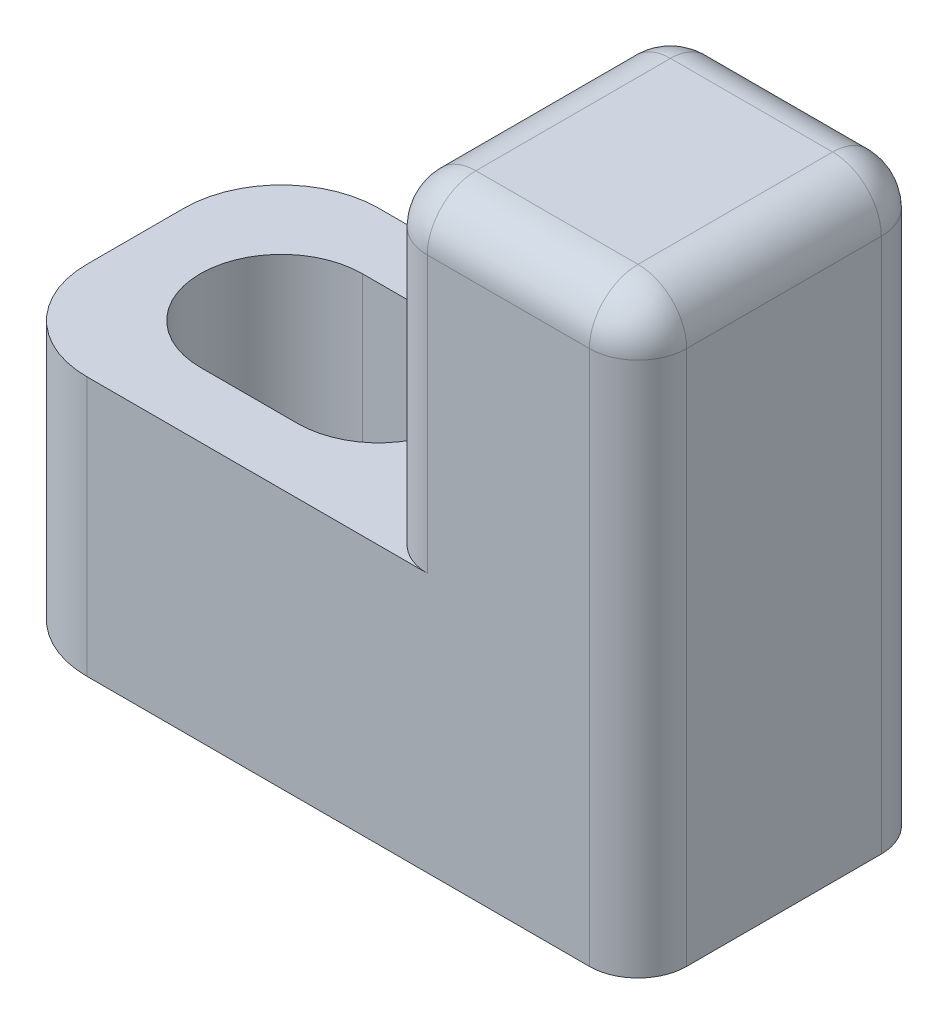
ISO-10303-21;
HEADER;
FILE_DESCRIPTION(('STEP AP214'),'2;1');
FILE_NAME('part.step','',(''),(''),'','','');
FILE_SCHEMA(('AUTOMOTIVE_DESIGN { 1 0 10303 214 1 1 1 1 }'));
ENDSEC;
DATA;
#1=APPLICATION_CONTEXT('core data for automotive mechanical design processes');
#2=APPLICATION_PROTOCOL_DEFINITION('international standard','automotive_design',2000,#1);
#3=PRODUCT_CONTEXT('',#1,'mechanical');
#4=PRODUCT('Part','Part','',(#3));
#5=PRODUCT_RELATED_PRODUCT_CATEGORY('part','',(#4));
#6=PRODUCT_DEFINITION_FORMATION('','',#4);
#7=PRODUCT_DEFINITION_CONTEXT('part definition',#1,'design');
#8=PRODUCT_DEFINITION('design','',#6,#7);
#9=PRODUCT_DEFINITION_SHAPE('','',#8);
#10=(LENGTH_UNIT() NAMED_UNIT(*) SI_UNIT(.MILLI.,.METRE.));
#11=(NAMED_UNIT(*) PLANE_ANGLE_UNIT() SI_UNIT($,.RADIAN.));
#12=(NAMED_UNIT(*) SI_UNIT($,.STERADIAN.) SOLID_ANGLE_UNIT());
#13=UNCERTAINTY_MEASURE_WITH_UNIT(LENGTH_MEASURE(1.E-05),#10,'distance_accuracy_value','');
#14=(GEOMETRIC_REPRESENTATION_CONTEXT(3) GLOBAL_UNCERTAINTY_ASSIGNED_CONTEXT((#13)) GLOBAL_UNIT_ASSIGNED_CONTEXT((#10,
#11,#12)) REPRESENTATION_CONTEXT('',''));
#15=CARTESIAN_POINT('',(0.,0.,0.));
#16=DIRECTION('',(0.,0.,1.));
#17=DIRECTION('',(1.,0.,0.));
#18=AXIS2_PLACEMENT_3D('',#15,#16,#17);
#19=CARTESIAN_POINT('',(0.,8.,0.));
#20=DIRECTION('',(0.,1.,0.));
#21=DIRECTION('',(0.,0.,1.));
#22=AXIS2_PLACEMENT_3D('',#19,#20,#21);
#23=PLANE('',#22);
#24=DIRECTION('',(-1.,0.,0.));
#25=VECTOR('',#24,1.);
#26=CARTESIAN_POINT('',(-10.,8.,-4.5));
#27=LINE('',#26,#25);
#28=CARTESIAN_POINT('',(3.5,8.,-4.5));
#29=VERTEX_POINT('',#28);
#30=CARTESIAN_POINT('',(-7.,8.,-4.5));
#31=VERTEX_POINT('',#30);
#32=EDGE_CURVE('E209',#29,#31,#27,.T.);
#33=ORIENTED_EDGE('',*,*,#32,.T.);
#34=CARTESIAN_POINT('',(-7.,8.,-1.5));
#35=DIRECTION('',(0.,1.,0.));
#36=DIRECTION('',(0.,0.,1.));
#37=AXIS2_PLACEMENT_3D('',#34,#35,#36);
#38=CIRCLE('',#37,3.);
#39=CARTESIAN_POINT('',(-10.,8.,-1.5));
#40=VERTEX_POINT('',#39);
#41=EDGE_CURVE('E241',#31,#40,#38,.T.);
#42=ORIENTED_EDGE('',*,*,#41,.T.);
#43=DIRECTION('',(0.,0.,1.));
#44=VECTOR('',#43,1.);
#45=CARTESIAN_POINT('',(-10.,8.,-4.5));
#46=LINE('',#45,#44);
#47=CARTESIAN_POINT('',(-10.,8.,1.5));
#48=VERTEX_POINT('',#47);
#49=EDGE_CURVE('E212',#40,#48,#46,.T.);
#50=ORIENTED_EDGE('',*,*,#49,.T.);
#51=CARTESIAN_POINT('',(-7.,8.,1.5));
#52=DIRECTION('',(0.,1.,0.));
#53=DIRECTION('',(0.,0.,1.));
#54=AXIS2_PLACEMENT_3D('',#51,#52,#53);
#55=CIRCLE('',#54,3.);
#56=CARTESIAN_POINT('',(-7.,8.,4.5));
#57=VERTEX_POINT('',#56);
#58=EDGE_CURVE('E239',#48,#57,#55,.T.);
#59=ORIENTED_EDGE('',*,*,#58,.T.);
#60=DIRECTION('',(1.,0.,0.));
#61=VECTOR('',#60,1.);
#62=CARTESIAN_POINT('',(-10.,8.,4.5));
#63=LINE('',#62,#61);
#64=CARTESIAN_POINT('',(3.5,8.,4.5));
#65=VERTEX_POINT('',#64);
#66=EDGE_CURVE('E216',#57,#65,#63,.T.);
#67=ORIENTED_EDGE('',*,*,#66,.T.);
#68=CARTESIAN_POINT('',(3.5,8.,3.));
#69=DIRECTION('',(0.,1.,0.));
#70=DIRECTION('',(0.,0.,1.));
#71=AXIS2_PLACEMENT_3D('',#68,#69,#70);
#72=CIRCLE('',#71,1.5);
#73=CARTESIAN_POINT('',(2.,8.,3.));
#74=VERTEX_POINT('',#73);
#75=EDGE_CURVE('E11',#65,#74,#72,.F.);
#76=ORIENTED_EDGE('',*,*,#75,.T.);
#77=DIRECTION('',(0.,0.,1.));
#78=VECTOR('',#77,1.);
#79=CARTESIAN_POINT('',(2.,8.,-4.5));
#80=LINE('',#79,#78);
#81=CARTESIAN_POINT('',(2.,8.,-3.));
#82=VERTEX_POINT('',#81);
#83=EDGE_CURVE('E198',#82,#74,#80,.T.);
#84=ORIENTED_EDGE('',*,*,#83,.F.);
#85=CARTESIAN_POINT('',(3.5,8.,-3.));
#86=DIRECTION('',(0.,1.,0.));
#87=DIRECTION('',(0.,0.,1.));
#88=AXIS2_PLACEMENT_3D('',#85,#86,#87);
#89=CIRCLE('',#88,1.5);
#90=EDGE_CURVE('E48',#82,#29,#89,.F.);
#91=ORIENTED_EDGE('',*,*,#90,.T.);
#92=EDGE_LOOP('',(#33,#42,#50,#59,#67,#76,#84,#91));
#93=FACE_BOUND('',#92,.T.);
#94=DIRECTION('',(1.,0.,0.));
#95=VECTOR('',#94,1.);
#96=CARTESIAN_POINT('',(-5.5,8.,2.5));
#97=LINE('',#96,#95);
#98=CARTESIAN_POINT('',(-5.5,8.,2.5));
#99=VERTEX_POINT('',#98);
#100=CARTESIAN_POINT('',(-2.5,8.,2.5));
#101=VERTEX_POINT('',#100);
#102=EDGE_CURVE('E176',#99,#101,#97,.T.);
#103=ORIENTED_EDGE('',*,*,#102,.F.);
#104=CARTESIAN_POINT('',(-5.5,8.,0.));
#105=DIRECTION('',(0.,1.,0.));
#106=DIRECTION('',(0.,0.,1.));
#107=AXIS2_PLACEMENT_3D('',#104,#105,#106);
#108=CIRCLE('',#107,2.5);
#109=CARTESIAN_POINT('',(-5.5,8.,-2.5));
#110=VERTEX_POINT('',#109);
#111=EDGE_CURVE('E166',#110,#99,#108,.T.);
#112=ORIENTED_EDGE('',*,*,#111,.F.);
#113=DIRECTION('',(-1.,0.,0.));
#114=VECTOR('',#113,1.);
#115=CARTESIAN_POINT('',(-5.5,8.,-2.5));
#116=LINE('',#115,#114);
#117=CARTESIAN_POINT('',(-2.5,8.,-2.5));
#118=VERTEX_POINT('',#117);
#119=EDGE_CURVE('E191',#118,#110,#116,.T.);
#120=ORIENTED_EDGE('',*,*,#119,.F.);
#121=CARTESIAN_POINT('',(-2.5,8.,0.));
#122=DIRECTION('',(0.,1.,0.));
#123=DIRECTION('',(0.,0.,1.));
#124=AXIS2_PLACEMENT_3D('',#121,#122,#123);
#125=CIRCLE('',#124,2.5);
#126=EDGE_CURVE('E189',#101,#118,#125,.T.);
#127=ORIENTED_EDGE('',*,*,#126,.F.);
#128=EDGE_LOOP('',(#103,#112,#120,#127));
#129=FACE_BOUND('',#128,.T.);
#130=ADVANCED_FACE('F39',(#93,#129),#23,.T.);
#131=CARTESIAN_POINT('',(0.,0.,0.));
#132=DIRECTION('',(0.,1.,0.));
#133=DIRECTION('',(0.,0.,1.));
#134=AXIS2_PLACEMENT_3D('',#131,#132,#133);
#135=PLANE('',#134);
#136=DIRECTION('',(-1.,0.,0.));
#137=VECTOR('',#136,1.);
#138=CARTESIAN_POINT('',(-10.,0.,-4.5));
#139=LINE('',#138,#137);
#140=CARTESIAN_POINT('',(8.5,0.,-4.5));
#141=VERTEX_POINT('',#140);
#142=CARTESIAN_POINT('',(-7.,0.,-4.5));
#143=VERTEX_POINT('',#142);
#144=EDGE_CURVE('E221',#141,#143,#139,.T.);
#145=ORIENTED_EDGE('',*,*,#144,.F.);
#146=CARTESIAN_POINT('',(8.5,0.,-3.));
#147=DIRECTION('',(0.,1.,0.));
#148=DIRECTION('',(0.,0.,1.));
#149=AXIS2_PLACEMENT_3D('',#146,#147,#148);
#150=CIRCLE('',#149,1.5);
#151=CARTESIAN_POINT('',(10.,0.,-3.));
#152=VERTEX_POINT('',#151);
#153=EDGE_CURVE('E255',#141,#152,#150,.F.);
#154=ORIENTED_EDGE('',*,*,#153,.T.);
#155=DIRECTION('',(0.,0.,-1.));
#156=VECTOR('',#155,1.);
#157=CARTESIAN_POINT('',(10.,0.,-4.5));
#158=LINE('',#157,#156);
#159=CARTESIAN_POINT('',(10.,0.,3.));
#160=VERTEX_POINT('',#159);
#161=EDGE_CURVE('E184',#160,#152,#158,.T.);
#162=ORIENTED_EDGE('',*,*,#161,.F.);
#163=CARTESIAN_POINT('',(8.5,0.,3.));
#164=DIRECTION('',(0.,1.,0.));
#165=DIRECTION('',(0.,0.,1.));
#166=AXIS2_PLACEMENT_3D('',#163,#164,#165);
#167=CIRCLE('',#166,1.5);
#168=CARTESIAN_POINT('',(8.5,0.,4.5));
#169=VERTEX_POINT('',#168);
#170=EDGE_CURVE('E253',#160,#169,#167,.F.);
#171=ORIENTED_EDGE('',*,*,#170,.T.);
#172=DIRECTION('',(1.,0.,0.));
#173=VECTOR('',#172,1.);
#174=CARTESIAN_POINT('',(-10.,0.,4.5));
#175=LINE('',#174,#173);
#176=CARTESIAN_POINT('',(-7.,0.,4.5));
#177=VERTEX_POINT('',#176);
#178=EDGE_CURVE('E213',#177,#169,#175,.T.);
#179=ORIENTED_EDGE('',*,*,#178,.F.);
#180=CARTESIAN_POINT('',(-7.,0.,1.5));
#181=DIRECTION('',(0.,1.,0.));
#182=DIRECTION('',(0.,0.,1.));
#183=AXIS2_PLACEMENT_3D('',#180,#181,#182);
#184=CIRCLE('',#183,3.);
#185=CARTESIAN_POINT('',(-10.,0.,1.5));
#186=VERTEX_POINT('',#185);
#187=EDGE_CURVE('E232',#177,#186,#184,.F.);
#188=ORIENTED_EDGE('',*,*,#187,.T.);
#189=DIRECTION('',(0.,0.,1.));
#190=VECTOR('',#189,1.);
#191=CARTESIAN_POINT('',(-10.,0.,-4.5));
#192=LINE('',#191,#190);
#193=CARTESIAN_POINT('',(-10.,0.,-1.5));
#194=VERTEX_POINT('',#193);
#195=EDGE_CURVE('E223',#194,#186,#192,.T.);
#196=ORIENTED_EDGE('',*,*,#195,.F.);
#197=CARTESIAN_POINT('',(-7.,0.,-1.5));
#198=DIRECTION('',(0.,1.,0.));
#199=DIRECTION('',(0.,0.,1.));
#200=AXIS2_PLACEMENT_3D('',#197,#198,#199);
#201=CIRCLE('',#200,3.);
#202=EDGE_CURVE('E234',#194,#143,#201,.F.);
#203=ORIENTED_EDGE('',*,*,#202,.T.);
#204=EDGE_LOOP('',(#145,#154,#162,#171,#179,#188,#196,#203));
#205=FACE_BOUND('',#204,.T.);
#206=CARTESIAN_POINT('',(-5.5,0.,0.));
#207=DIRECTION('',(0.,1.,0.));
#208=DIRECTION('',(0.,0.,1.));
#209=AXIS2_PLACEMENT_3D('',#206,#207,#208);
#210=CIRCLE('',#209,2.5);
#211=CARTESIAN_POINT('',(-5.5,0.,-2.5));
#212=VERTEX_POINT('',#211);
#213=CARTESIAN_POINT('',(-5.5,0.,2.5));
#214=VERTEX_POINT('',#213);
#215=EDGE_CURVE('E196',#212,#214,#210,.T.);
#216=ORIENTED_EDGE('',*,*,#215,.T.);
#217=DIRECTION('',(1.,0.,0.));
#218=VECTOR('',#217,1.);
#219=CARTESIAN_POINT('',(-5.5,0.,2.5));
#220=LINE('',#219,#218);
#221=CARTESIAN_POINT('',(-2.5,0.,2.5));
#222=VERTEX_POINT('',#221);
#223=EDGE_CURVE('E183',#214,#222,#220,.T.);
#224=ORIENTED_EDGE('',*,*,#223,.T.);
#225=CARTESIAN_POINT('',(-2.5,0.,0.));
#226=DIRECTION('',(0.,1.,0.));
#227=DIRECTION('',(0.,0.,1.));
#228=AXIS2_PLACEMENT_3D('',#225,#226,#227);
#229=CIRCLE('',#228,2.5);
#230=CARTESIAN_POINT('',(-2.5,0.,-2.5));
#231=VERTEX_POINT('',#230);
#232=EDGE_CURVE('E200',#222,#231,#229,.T.);
#233=ORIENTED_EDGE('',*,*,#232,.T.);
#234=DIRECTION('',(-1.,0.,0.));
#235=VECTOR('',#234,1.);
#236=CARTESIAN_POINT('',(-5.5,0.,-2.5));
#237=LINE('',#236,#235);
#238=EDGE_CURVE('E177',#231,#212,#237,.T.);
#239=ORIENTED_EDGE('',*,*,#238,.T.);
#240=EDGE_LOOP('',(#216,#224,#233,#239));
#241=FACE_BOUND('',#240,.T.);
#242=ADVANCED_FACE('F358',(#205,#241),#135,.F.);
#243=CARTESIAN_POINT('',(10.,8.,-4.5));
#244=DIRECTION('',(-1.,0.,0.));
#245=DIRECTION('',(0.,0.,1.));
#246=AXIS2_PLACEMENT_3D('',#243,#244,#245);
#247=PLANE('',#246);
#248=ORIENTED_EDGE('',*,*,#161,.T.);
#249=DIRECTION('',(0.,-1.,0.));
#250=VECTOR('',#249,1.);
#251=CARTESIAN_POINT('',(10.,8.,-3.));
#252=LINE('',#251,#250);
#253=CARTESIAN_POINT('',(10.,16.5,-3.));
#254=VERTEX_POINT('',#253);
#255=EDGE_CURVE('E261',#152,#254,#252,.F.);
#256=ORIENTED_EDGE('',*,*,#255,.T.);
#257=DIRECTION('',(0.,0.,-1.));
#258=VECTOR('',#257,1.);
#259=CARTESIAN_POINT('',(10.,16.5,-4.5));
#260=LINE('',#259,#258);
#261=CARTESIAN_POINT('',(10.,16.5,3.));
#262=VERTEX_POINT('',#261);
#263=EDGE_CURVE('E257',#254,#262,#260,.F.);
#264=ORIENTED_EDGE('',*,*,#263,.T.);
#265=DIRECTION('',(0.,-1.,0.));
#266=VECTOR('',#265,1.);
#267=CARTESIAN_POINT('',(10.,8.,3.));
#268=LINE('',#267,#266);
#269=EDGE_CURVE('E259',#262,#160,#268,.T.);
#270=ORIENTED_EDGE('',*,*,#269,.T.);
#271=EDGE_LOOP('',(#248,#256,#264,#270));
#272=FACE_BOUND('',#271,.T.);
#273=ADVANCED_FACE('F392',(#272),#247,.F.);
#274=CARTESIAN_POINT('',(-10.,8.,-4.5));
#275=DIRECTION('',(0.,0.,1.));
#276=DIRECTION('',(1.,0.,0.));
#277=AXIS2_PLACEMENT_3D('',#274,#275,#276);
#278=PLANE('',#277);
#279=DIRECTION('',(-1.,0.,0.));
#280=VECTOR('',#279,1.);
#281=CARTESIAN_POINT('',(-10.,16.5,-4.5));
#282=LINE('',#281,#280);
#283=CARTESIAN_POINT('',(3.5,16.5,-4.5));
#284=VERTEX_POINT('',#283);
#285=CARTESIAN_POINT('',(8.5,16.5,-4.5));
#286=VERTEX_POINT('',#285);
#287=EDGE_CURVE('E246',#284,#286,#282,.F.);
#288=ORIENTED_EDGE('',*,*,#287,.T.);
#289=DIRECTION('',(0.,-1.,0.));
#290=VECTOR('',#289,1.);
#291=CARTESIAN_POINT('',(8.5,8.,-4.5));
#292=LINE('',#291,#290);
#293=EDGE_CURVE('E250',#286,#141,#292,.T.);
#294=ORIENTED_EDGE('',*,*,#293,.T.);
#295=ORIENTED_EDGE('',*,*,#144,.T.);
#296=DIRECTION('',(0.,-1.,0.));
#297=VECTOR('',#296,1.);
#298=CARTESIAN_POINT('',(-7.,8.,-4.5));
#299=LINE('',#298,#297);
#300=EDGE_CURVE('E237',#143,#31,#299,.F.);
#301=ORIENTED_EDGE('',*,*,#300,.T.);
#302=ORIENTED_EDGE('',*,*,#32,.F.);
#303=DIRECTION('',(0.,-1.,0.));
#304=VECTOR('',#303,1.);
#305=CARTESIAN_POINT('',(3.5,8.,-4.5));
#306=LINE('',#305,#304);
#307=EDGE_CURVE('E248',#29,#284,#306,.F.);
#308=ORIENTED_EDGE('',*,*,#307,.T.);
#309=EDGE_LOOP('',(#288,#294,#295,#301,#302,#308));
#310=FACE_BOUND('',#309,.T.);
#311=ADVANCED_FACE('F389',(#310),#278,.F.);
#312=CARTESIAN_POINT('',(-10.,8.,-4.5));
#313=DIRECTION('',(1.,0.,0.));
#314=DIRECTION('',(0.,0.,-1.));
#315=AXIS2_PLACEMENT_3D('',#312,#313,#314);
#316=PLANE('',#315);
#317=ORIENTED_EDGE('',*,*,#49,.F.);
#318=DIRECTION('',(0.,-1.,0.));
#319=VECTOR('',#318,1.);
#320=CARTESIAN_POINT('',(-10.,8.,-1.5));
#321=LINE('',#320,#319);
#322=EDGE_CURVE('E229',#40,#194,#321,.T.);
#323=ORIENTED_EDGE('',*,*,#322,.T.);
#324=ORIENTED_EDGE('',*,*,#195,.T.);
#325=DIRECTION('',(0.,-1.,0.));
#326=VECTOR('',#325,1.);
#327=CARTESIAN_POINT('',(-10.,8.,1.5));
#328=LINE('',#327,#326);
#329=EDGE_CURVE('E218',#186,#48,#328,.F.);
#330=ORIENTED_EDGE('',*,*,#329,.T.);
#331=EDGE_LOOP('',(#317,#323,#324,#330));
#332=FACE_BOUND('',#331,.T.);
#333=ADVANCED_FACE('F354',(#332),#316,.F.);
#334=CARTESIAN_POINT('',(-10.,8.,4.5));
#335=DIRECTION('',(0.,0.,-1.));
#336=DIRECTION('',(-1.,0.,0.));
#337=AXIS2_PLACEMENT_3D('',#334,#335,#336);
#338=PLANE('',#337);
#339=DIRECTION('',(0.,-1.,0.));
#340=VECTOR('',#339,1.);
#341=CARTESIAN_POINT('',(3.5,8.,4.5));
#342=LINE('',#341,#340);
#343=CARTESIAN_POINT('',(3.5,16.5,4.5));
#344=VERTEX_POINT('',#343);
#345=EDGE_CURVE('E271',#344,#65,#342,.T.);
#346=ORIENTED_EDGE('',*,*,#345,.T.);
#347=ORIENTED_EDGE('',*,*,#66,.F.);
#348=DIRECTION('',(0.,-1.,0.));
#349=VECTOR('',#348,1.);
#350=CARTESIAN_POINT('',(-7.,8.,4.5));
#351=LINE('',#350,#349);
#352=EDGE_CURVE('E243',#57,#177,#351,.T.);
#353=ORIENTED_EDGE('',*,*,#352,.T.);
#354=ORIENTED_EDGE('',*,*,#178,.T.);
#355=DIRECTION('',(0.,-1.,0.));
#356=VECTOR('',#355,1.);
#357=CARTESIAN_POINT('',(8.5,8.,4.5));
#358=LINE('',#357,#356);
#359=CARTESIAN_POINT('',(8.5,16.5,4.5));
#360=VERTEX_POINT('',#359);
#361=EDGE_CURVE('E274',#169,#360,#358,.F.);
#362=ORIENTED_EDGE('',*,*,#361,.T.);
#363=DIRECTION('',(1.,0.,0.));
#364=VECTOR('',#363,1.);
#365=CARTESIAN_POINT('',(-10.,16.5,4.5));
#366=LINE('',#365,#364);
#367=EDGE_CURVE('E269',#360,#344,#366,.F.);
#368=ORIENTED_EDGE('',*,*,#367,.T.);
#369=EDGE_LOOP('',(#346,#347,#353,#354,#362,#368));
#370=FACE_BOUND('',#369,.T.);
#371=ADVANCED_FACE('F367',(#370),#338,.F.);
#372=CARTESIAN_POINT('',(-5.5,8.,0.));
#373=DIRECTION('',(0.,-1.,0.));
#374=DIRECTION('',(0.,0.,-1.));
#375=AXIS2_PLACEMENT_3D('',#372,#373,#374);
#376=CYLINDRICAL_SURFACE('',#375,2.5);
#377=ORIENTED_EDGE('',*,*,#215,.F.);
#378=DIRECTION('',(0.,-1.,0.));
#379=VECTOR('',#378,1.);
#380=CARTESIAN_POINT('',(-5.5,8.,-2.5));
#381=LINE('',#380,#379);
#382=EDGE_CURVE('E172',#110,#212,#381,.T.);
#383=ORIENTED_EDGE('',*,*,#382,.F.);
#384=ORIENTED_EDGE('',*,*,#111,.T.);
#385=DIRECTION('',(0.,-1.,0.));
#386=VECTOR('',#385,1.);
#387=CARTESIAN_POINT('',(-5.5,8.,2.5));
#388=LINE('',#387,#386);
#389=EDGE_CURVE('E169',#99,#214,#388,.T.);
#390=ORIENTED_EDGE('',*,*,#389,.T.);
#391=EDGE_LOOP('',(#377,#383,#384,#390));
#392=FACE_BOUND('',#391,.T.);
#393=ADVANCED_FACE('F168',(#392),#376,.F.);
#394=CARTESIAN_POINT('',(-5.5,8.,2.5));
#395=DIRECTION('',(0.,0.,-1.));
#396=DIRECTION('',(-1.,0.,0.));
#397=AXIS2_PLACEMENT_3D('',#394,#395,#396);
#398=PLANE('',#397);
#399=ORIENTED_EDGE('',*,*,#223,.F.);
#400=ORIENTED_EDGE('',*,*,#389,.F.);
#401=ORIENTED_EDGE('',*,*,#102,.T.);
#402=DIRECTION('',(0.,-1.,0.));
#403=VECTOR('',#402,1.);
#404=CARTESIAN_POINT('',(-2.5,8.,2.5));
#405=LINE('',#404,#403);
#406=EDGE_CURVE('E185',#101,#222,#405,.T.);
#407=ORIENTED_EDGE('',*,*,#406,.T.);
#408=EDGE_LOOP('',(#399,#400,#401,#407));
#409=FACE_BOUND('',#408,.T.);
#410=ADVANCED_FACE('F180',(#409),#398,.T.);
#411=CARTESIAN_POINT('',(-2.5,8.,0.));
#412=DIRECTION('',(0.,-1.,0.));
#413=DIRECTION('',(0.,0.,-1.));
#414=AXIS2_PLACEMENT_3D('',#411,#412,#413);
#415=CYLINDRICAL_SURFACE('',#414,2.5);
#416=ORIENTED_EDGE('',*,*,#232,.F.);
#417=ORIENTED_EDGE('',*,*,#406,.F.);
#418=ORIENTED_EDGE('',*,*,#126,.T.);
#419=DIRECTION('',(0.,-1.,0.));
#420=VECTOR('',#419,1.);
#421=CARTESIAN_POINT('',(-2.5,8.,-2.5));
#422=LINE('',#421,#420);
#423=EDGE_CURVE('E206',#118,#231,#422,.T.);
#424=ORIENTED_EDGE('',*,*,#423,.T.);
#425=EDGE_LOOP('',(#416,#417,#418,#424));
#426=FACE_BOUND('',#425,.T.);
#427=ADVANCED_FACE('F434',(#426),#415,.F.);
#428=CARTESIAN_POINT('',(-5.5,8.,-2.5));
#429=DIRECTION('',(0.,0.,1.));
#430=DIRECTION('',(1.,0.,0.));
#431=AXIS2_PLACEMENT_3D('',#428,#429,#430);
#432=PLANE('',#431);
#433=ORIENTED_EDGE('',*,*,#238,.F.);
#434=ORIENTED_EDGE('',*,*,#423,.F.);
#435=ORIENTED_EDGE('',*,*,#119,.T.);
#436=ORIENTED_EDGE('',*,*,#382,.T.);
#437=EDGE_LOOP('',(#433,#434,#435,#436));
#438=FACE_BOUND('',#437,.T.);
#439=ADVANCED_FACE('F440',(#438),#432,.T.);
#440=CARTESIAN_POINT('',(2.,18.,-4.5));
#441=DIRECTION('',(1.,0.,0.));
#442=DIRECTION('',(0.,0.,-1.));
#443=AXIS2_PLACEMENT_3D('',#440,#441,#442);
#444=PLANE('',#443);
#445=DIRECTION('',(0.,0.,1.));
#446=VECTOR('',#445,1.);
#447=CARTESIAN_POINT('',(2.,16.5,-4.5));
#448=LINE('',#447,#446);
#449=CARTESIAN_POINT('',(2.,16.5,3.));
#450=VERTEX_POINT('',#449);
#451=CARTESIAN_POINT('',(2.,16.5,-3.));
#452=VERTEX_POINT('',#451);
#453=EDGE_CURVE('E263',#450,#452,#448,.F.);
#454=ORIENTED_EDGE('',*,*,#453,.T.);
#455=DIRECTION('',(0.,-1.,0.));
#456=VECTOR('',#455,1.);
#457=CARTESIAN_POINT('',(2.,18.,-3.));
#458=LINE('',#457,#456);
#459=EDGE_CURVE('E267',#452,#82,#458,.T.);
#460=ORIENTED_EDGE('',*,*,#459,.T.);
#461=ORIENTED_EDGE('',*,*,#83,.T.);
#462=DIRECTION('',(0.,-1.,0.));
#463=VECTOR('',#462,1.);
#464=CARTESIAN_POINT('',(2.,18.,3.));
#465=LINE('',#464,#463);
#466=EDGE_CURVE('E265',#74,#450,#465,.F.);
#467=ORIENTED_EDGE('',*,*,#466,.T.);
#468=EDGE_LOOP('',(#454,#460,#461,#467));
#469=FACE_BOUND('',#468,.T.);
#470=ADVANCED_FACE('F327',(#469),#444,.F.);
#471=CARTESIAN_POINT('',(0.,18.,0.));
#472=DIRECTION('',(0.,-1.,0.));
#473=DIRECTION('',(0.,0.,-1.));
#474=AXIS2_PLACEMENT_3D('',#471,#472,#473);
#475=PLANE('',#474);
#476=DIRECTION('',(0.,0.,1.));
#477=VECTOR('',#476,1.);
#478=CARTESIAN_POINT('',(3.5,18.,0.));
#479=LINE('',#478,#477);
#480=CARTESIAN_POINT('',(3.5,18.,-3.));
#481=VERTEX_POINT('',#480);
#482=CARTESIAN_POINT('',(3.5,18.,3.));
#483=VERTEX_POINT('',#482);
#484=EDGE_CURVE('E276',#481,#483,#479,.T.);
#485=ORIENTED_EDGE('',*,*,#484,.T.);
#486=DIRECTION('',(1.,0.,0.));
#487=VECTOR('',#486,1.);
#488=CARTESIAN_POINT('',(0.,18.,3.));
#489=LINE('',#488,#487);
#490=CARTESIAN_POINT('',(8.5,18.,3.));
#491=VERTEX_POINT('',#490);
#492=EDGE_CURVE('E281',#483,#491,#489,.T.);
#493=ORIENTED_EDGE('',*,*,#492,.T.);
#494=DIRECTION('',(0.,0.,-1.));
#495=VECTOR('',#494,1.);
#496=CARTESIAN_POINT('',(8.5,18.,0.));
#497=LINE('',#496,#495);
#498=CARTESIAN_POINT('',(8.5,18.,-3.));
#499=VERTEX_POINT('',#498);
#500=EDGE_CURVE('E56',#491,#499,#497,.T.);
#501=ORIENTED_EDGE('',*,*,#500,.T.);
#502=DIRECTION('',(-1.,0.,0.));
#503=VECTOR('',#502,1.);
#504=CARTESIAN_POINT('',(0.,18.,-3.));
#505=LINE('',#504,#503);
#506=EDGE_CURVE('E278',#499,#481,#505,.T.);
#507=ORIENTED_EDGE('',*,*,#506,.T.);
#508=EDGE_LOOP('',(#485,#493,#501,#507));
#509=FACE_BOUND('',#508,.T.);
#510=ADVANCED_FACE('F453',(#509),#475,.F.);
#511=CARTESIAN_POINT('',(-7.,8.,-1.5));
#512=DIRECTION('',(0.,-1.,0.));
#513=DIRECTION('',(0.,0.,-1.));
#514=AXIS2_PLACEMENT_3D('',#511,#512,#513);
#515=CYLINDRICAL_SURFACE('',#514,3.);
#516=ORIENTED_EDGE('',*,*,#41,.F.);
#517=ORIENTED_EDGE('',*,*,#300,.F.);
#518=ORIENTED_EDGE('',*,*,#202,.F.);
#519=ORIENTED_EDGE('',*,*,#322,.F.);
#520=EDGE_LOOP('',(#516,#517,#518,#519));
#521=FACE_BOUND('',#520,.T.);
#522=ADVANCED_FACE('F351',(#521),#515,.T.);
#523=CARTESIAN_POINT('',(-7.,8.,1.5));
#524=DIRECTION('',(0.,-1.,0.));
#525=DIRECTION('',(0.,0.,-1.));
#526=AXIS2_PLACEMENT_3D('',#523,#524,#525);
#527=CYLINDRICAL_SURFACE('',#526,3.);
#528=ORIENTED_EDGE('',*,*,#58,.F.);
#529=ORIENTED_EDGE('',*,*,#329,.F.);
#530=ORIENTED_EDGE('',*,*,#187,.F.);
#531=ORIENTED_EDGE('',*,*,#352,.F.);
#532=EDGE_LOOP('',(#528,#529,#530,#531));
#533=FACE_BOUND('',#532,.T.);
#534=ADVANCED_FACE('F364',(#533),#527,.T.);
#535=CARTESIAN_POINT('',(3.5,8.,3.));
#536=DIRECTION('',(0.,-1.,0.));
#537=DIRECTION('',(0.,0.,-1.));
#538=AXIS2_PLACEMENT_3D('',#535,#536,#537);
#539=CYLINDRICAL_SURFACE('',#538,1.5);
#540=CARTESIAN_POINT('',(3.5,16.5,3.));
#541=DIRECTION('',(0.,1.,0.));
#542=DIRECTION('',(0.,0.,1.));
#543=AXIS2_PLACEMENT_3D('',#540,#541,#542);
#544=CIRCLE('',#543,1.5);
#545=EDGE_CURVE('E43',#450,#344,#544,.T.);
#546=ORIENTED_EDGE('',*,*,#545,.F.);
#547=ORIENTED_EDGE('',*,*,#466,.F.);
#548=ORIENTED_EDGE('',*,*,#75,.F.);
#549=ORIENTED_EDGE('',*,*,#345,.F.);
#550=EDGE_LOOP('',(#546,#547,#548,#549));
#551=FACE_BOUND('',#550,.T.);
#552=ADVANCED_FACE('F41',(#551),#539,.T.);
#553=CARTESIAN_POINT('',(3.5,16.5,3.));
#554=DIRECTION('',(0.,0.,1.));
#555=DIRECTION('',(1.,0.,0.));
#556=AXIS2_PLACEMENT_3D('',#553,#554,#555);
#557=SPHERICAL_SURFACE('',#556,1.5);
#558=CARTESIAN_POINT('',(3.5,16.5,3.));
#559=DIRECTION('',(0.,0.,1.));
#560=DIRECTION('',(1.,0.,0.));
#561=AXIS2_PLACEMENT_3D('',#558,#559,#560);
#562=CIRCLE('',#561,1.5);
#563=EDGE_CURVE('E311',#450,#483,#562,.F.);
#564=ORIENTED_EDGE('',*,*,#563,.F.);
#565=ORIENTED_EDGE('',*,*,#545,.T.);
#566=CARTESIAN_POINT('',(3.5,16.5,3.));
#567=DIRECTION('',(-1.,0.,0.));
#568=DIRECTION('',(0.,0.,1.));
#569=AXIS2_PLACEMENT_3D('',#566,#567,#568);
#570=CIRCLE('',#569,1.5);
#571=EDGE_CURVE('E313',#483,#344,#570,.F.);
#572=ORIENTED_EDGE('',*,*,#571,.F.);
#573=EDGE_LOOP('',(#564,#565,#572));
#574=FACE_BOUND('',#573,.T.);
#575=ADVANCED_FACE('F335',(#574),#557,.T.);
#576=CARTESIAN_POINT('',(8.5,8.,3.));
#577=DIRECTION('',(0.,-1.,0.));
#578=DIRECTION('',(0.,0.,-1.));
#579=AXIS2_PLACEMENT_3D('',#576,#577,#578);
#580=CYLINDRICAL_SURFACE('',#579,1.5);
#581=ORIENTED_EDGE('',*,*,#170,.F.);
#582=ORIENTED_EDGE('',*,*,#269,.F.);
#583=CARTESIAN_POINT('',(8.5,16.5,3.));
#584=DIRECTION('',(0.,1.,0.));
#585=DIRECTION('',(0.,0.,1.));
#586=AXIS2_PLACEMENT_3D('',#583,#584,#585);
#587=CIRCLE('',#586,1.5);
#588=EDGE_CURVE('E308',#360,#262,#587,.T.);
#589=ORIENTED_EDGE('',*,*,#588,.F.);
#590=ORIENTED_EDGE('',*,*,#361,.F.);
#591=EDGE_LOOP('',(#581,#582,#589,#590));
#592=FACE_BOUND('',#591,.T.);
#593=ADVANCED_FACE('F375',(#592),#580,.T.);
#594=CARTESIAN_POINT('',(0.,16.5,3.));
#595=DIRECTION('',(1.,0.,0.));
#596=DIRECTION('',(0.,0.,-1.));
#597=AXIS2_PLACEMENT_3D('',#594,#595,#596);
#598=CYLINDRICAL_SURFACE('',#597,1.5);
#599=ORIENTED_EDGE('',*,*,#571,.T.);
#600=ORIENTED_EDGE('',*,*,#367,.F.);
#601=CARTESIAN_POINT('',(8.5,16.5,3.));
#602=DIRECTION('',(1.,0.,0.));
#603=DIRECTION('',(0.,0.,-1.));
#604=AXIS2_PLACEMENT_3D('',#601,#602,#603);
#605=CIRCLE('',#604,1.5);
#606=EDGE_CURVE('E305',#491,#360,#605,.T.);
#607=ORIENTED_EDGE('',*,*,#606,.F.);
#608=ORIENTED_EDGE('',*,*,#492,.F.);
#609=EDGE_LOOP('',(#599,#600,#607,#608));
#610=FACE_BOUND('',#609,.T.);
#611=ADVANCED_FACE('F371',(#610),#598,.T.);
#612=CARTESIAN_POINT('',(3.5,16.5,0.));
#613=DIRECTION('',(0.,0.,1.));
#614=DIRECTION('',(1.,0.,0.));
#615=AXIS2_PLACEMENT_3D('',#612,#613,#614);
#616=CYLINDRICAL_SURFACE('',#615,1.5);
#617=ORIENTED_EDGE('',*,*,#563,.T.);
#618=ORIENTED_EDGE('',*,*,#484,.F.);
#619=CARTESIAN_POINT('',(3.5,16.5,-3.));
#620=DIRECTION('',(0.,0.,-1.));
#621=DIRECTION('',(-1.,0.,0.));
#622=AXIS2_PLACEMENT_3D('',#619,#620,#621);
#623=CIRCLE('',#622,1.5);
#624=EDGE_CURVE('E302',#452,#481,#623,.T.);
#625=ORIENTED_EDGE('',*,*,#624,.F.);
#626=ORIENTED_EDGE('',*,*,#453,.F.);
#627=EDGE_LOOP('',(#617,#618,#625,#626));
#628=FACE_BOUND('',#627,.T.);
#629=ADVANCED_FACE('F339',(#628),#616,.T.);
#630=CARTESIAN_POINT('',(3.5,18.,-3.));
#631=DIRECTION('',(0.,-1.,0.));
#632=DIRECTION('',(0.,0.,-1.));
#633=AXIS2_PLACEMENT_3D('',#630,#631,#632);
#634=CYLINDRICAL_SURFACE('',#633,1.5);
#635=ORIENTED_EDGE('',*,*,#90,.F.);
#636=ORIENTED_EDGE('',*,*,#459,.F.);
#637=CARTESIAN_POINT('',(3.5,16.5,-3.));
#638=DIRECTION('',(0.,1.,0.));
#639=DIRECTION('',(0.,0.,1.));
#640=AXIS2_PLACEMENT_3D('',#637,#638,#639);
#641=CIRCLE('',#640,1.5);
#642=EDGE_CURVE('E299',#284,#452,#641,.T.);
#643=ORIENTED_EDGE('',*,*,#642,.F.);
#644=ORIENTED_EDGE('',*,*,#307,.F.);
#645=EDGE_LOOP('',(#635,#636,#643,#644));
#646=FACE_BOUND('',#645,.T.);
#647=ADVANCED_FACE('F342',(#646),#634,.T.);
#648=CARTESIAN_POINT('',(8.5,16.5,3.));
#649=DIRECTION('',(0.,0.,1.));
#650=DIRECTION('',(1.,0.,0.));
#651=AXIS2_PLACEMENT_3D('',#648,#649,#650);
#652=SPHERICAL_SURFACE('',#651,1.5);
#653=ORIENTED_EDGE('',*,*,#606,.T.);
#654=ORIENTED_EDGE('',*,*,#588,.T.);
#655=CARTESIAN_POINT('',(8.5,16.5,3.));
#656=DIRECTION('',(0.,0.,1.));
#657=DIRECTION('',(0.,-1.,0.));
#658=AXIS2_PLACEMENT_3D('',#655,#656,#657);
#659=CIRCLE('',#658,1.5);
#660=EDGE_CURVE('E297',#491,#262,#659,.F.);
#661=ORIENTED_EDGE('',*,*,#660,.F.);
#662=EDGE_LOOP('',(#653,#654,#661));
#663=FACE_BOUND('',#662,.T.);
#664=ADVANCED_FACE('F377',(#663),#652,.T.);
#665=CARTESIAN_POINT('',(3.5,16.5,-3.));
#666=DIRECTION('',(-1.,0.,0.));
#667=DIRECTION('',(0.,0.,1.));
#668=AXIS2_PLACEMENT_3D('',#665,#666,#667);
#669=SPHERICAL_SURFACE('',#668,1.5);
#670=ORIENTED_EDGE('',*,*,#642,.T.);
#671=ORIENTED_EDGE('',*,*,#624,.T.);
#672=CARTESIAN_POINT('',(3.5,16.5,-3.));
#673=DIRECTION('',(-1.,0.,0.));
#674=DIRECTION('',(0.,0.,1.));
#675=AXIS2_PLACEMENT_3D('',#672,#673,#674);
#676=CIRCLE('',#675,1.5);
#677=EDGE_CURVE('E294',#284,#481,#676,.F.);
#678=ORIENTED_EDGE('',*,*,#677,.F.);
#679=EDGE_LOOP('',(#670,#671,#678));
#680=FACE_BOUND('',#679,.T.);
#681=ADVANCED_FACE('F510',(#680),#669,.T.);
#682=CARTESIAN_POINT('',(8.5,16.5,0.));
#683=DIRECTION('',(0.,0.,-1.));
#684=DIRECTION('',(-1.,0.,0.));
#685=AXIS2_PLACEMENT_3D('',#682,#683,#684);
#686=CYLINDRICAL_SURFACE('',#685,1.5);
#687=ORIENTED_EDGE('',*,*,#660,.T.);
#688=ORIENTED_EDGE('',*,*,#263,.F.);
#689=CARTESIAN_POINT('',(8.5,16.5,-3.));
#690=DIRECTION('',(0.,0.,-1.));
#691=DIRECTION('',(-1.,0.,0.));
#692=AXIS2_PLACEMENT_3D('',#689,#690,#691);
#693=CIRCLE('',#692,1.5);
#694=EDGE_CURVE('E291',#499,#254,#693,.T.);
#695=ORIENTED_EDGE('',*,*,#694,.F.);
#696=ORIENTED_EDGE('',*,*,#500,.F.);
#697=EDGE_LOOP('',(#687,#688,#695,#696));
#698=FACE_BOUND('',#697,.T.);
#699=ADVANCED_FACE('F379',(#698),#686,.T.);
#700=CARTESIAN_POINT('',(0.,16.5,-3.));
#701=DIRECTION('',(-1.,0.,0.));
#702=DIRECTION('',(0.,0.,1.));
#703=AXIS2_PLACEMENT_3D('',#700,#701,#702);
#704=CYLINDRICAL_SURFACE('',#703,1.5);
#705=ORIENTED_EDGE('',*,*,#677,.T.);
#706=ORIENTED_EDGE('',*,*,#506,.F.);
#707=CARTESIAN_POINT('',(8.5,16.5,-3.));
#708=DIRECTION('',(1.,0.,0.));
#709=DIRECTION('',(0.,1.,0.));
#710=AXIS2_PLACEMENT_3D('',#707,#708,#709);
#711=CIRCLE('',#710,1.5);
#712=EDGE_CURVE('E288',#286,#499,#711,.T.);
#713=ORIENTED_EDGE('',*,*,#712,.F.);
#714=ORIENTED_EDGE('',*,*,#287,.F.);
#715=EDGE_LOOP('',(#705,#706,#713,#714));
#716=FACE_BOUND('',#715,.T.);
#717=ADVANCED_FACE('F524',(#716),#704,.T.);
#718=CARTESIAN_POINT('',(8.5,16.5,-3.));
#719=DIRECTION('',(0.,1.,0.));
#720=DIRECTION('',(0.,0.,1.));
#721=AXIS2_PLACEMENT_3D('',#718,#719,#720);
#722=SPHERICAL_SURFACE('',#721,1.5);
#723=ORIENTED_EDGE('',*,*,#712,.T.);
#724=ORIENTED_EDGE('',*,*,#694,.T.);
#725=CARTESIAN_POINT('',(8.5,16.5,-3.));
#726=DIRECTION('',(0.,1.,0.));
#727=DIRECTION('',(0.,0.,1.));
#728=AXIS2_PLACEMENT_3D('',#725,#726,#727);
#729=CIRCLE('',#728,1.5);
#730=EDGE_CURVE('E285',#286,#254,#729,.F.);
#731=ORIENTED_EDGE('',*,*,#730,.F.);
#732=EDGE_LOOP('',(#723,#724,#731));
#733=FACE_BOUND('',#732,.T.);
#734=ADVANCED_FACE('F383',(#733),#722,.T.);
#735=CARTESIAN_POINT('',(8.5,8.,-3.));
#736=DIRECTION('',(0.,-1.,0.));
#737=DIRECTION('',(0.,0.,-1.));
#738=AXIS2_PLACEMENT_3D('',#735,#736,#737);
#739=CYLINDRICAL_SURFACE('',#738,1.5);
#740=ORIENTED_EDGE('',*,*,#730,.T.);
#741=ORIENTED_EDGE('',*,*,#255,.F.);
#742=ORIENTED_EDGE('',*,*,#153,.F.);
#743=ORIENTED_EDGE('',*,*,#293,.F.);
#744=EDGE_LOOP('',(#740,#741,#742,#743));
#745=FACE_BOUND('',#744,.T.);
#746=ADVANCED_FACE('F388',(#745),#739,.T.);
#747=CLOSED_SHELL('',(#130,#242,#273,#311,#333,#371,#393,#410,#427,#439,#470,#510,#522,#534,
#552,#575,#593,#611,#629,#647,#664,#681,#699,#717,#734,#746));
#748=MANIFOLD_SOLID_BREP('B2',#747);
#749=ADVANCED_BREP_SHAPE_REPRESENTATION('',(#18,#748),#14);
#750=SHAPE_DEFINITION_REPRESENTATION(#9,#749);
ENDSEC;
END-ISO-10303-21;
